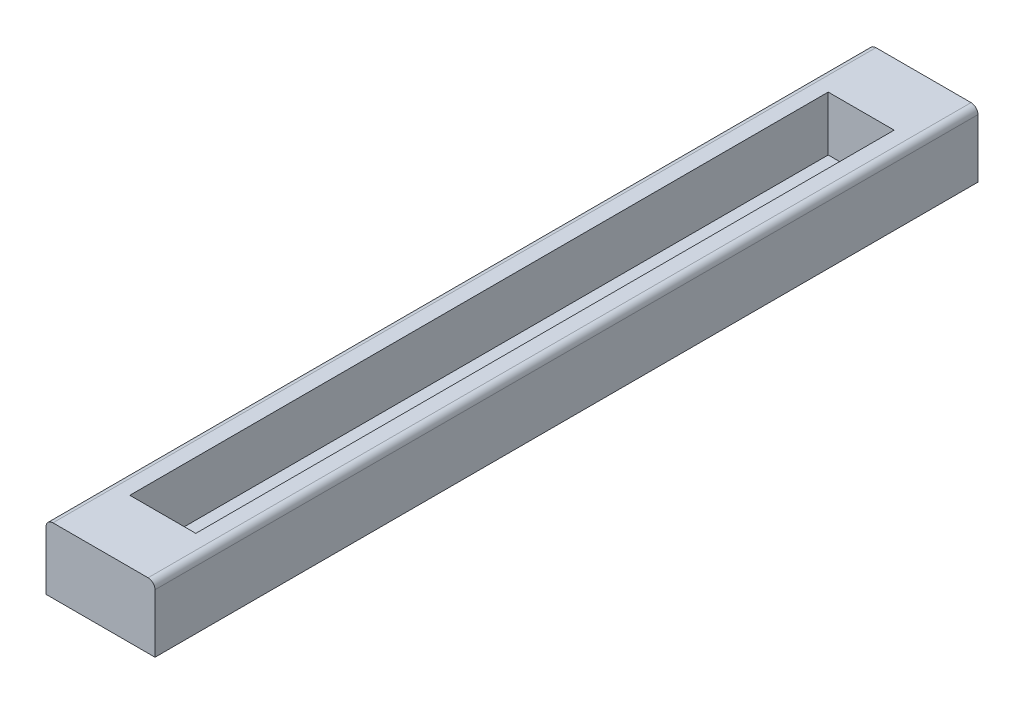
ISO-10303-21;
HEADER;
FILE_DESCRIPTION(('STEP AP214'),'2;1');
FILE_NAME('part.step','',(''),(''),'','','');
FILE_SCHEMA(('AUTOMOTIVE_DESIGN { 1 0 10303 214 1 1 1 1 }'));
ENDSEC;
DATA;
#1=APPLICATION_CONTEXT('core data for automotive mechanical design processes');
#2=APPLICATION_PROTOCOL_DEFINITION('international standard','automotive_design',2000,#1);
#3=PRODUCT_CONTEXT('',#1,'mechanical');
#4=PRODUCT('Part','Part','',(#3));
#5=PRODUCT_RELATED_PRODUCT_CATEGORY('part','',(#4));
#6=PRODUCT_DEFINITION_FORMATION('','',#4);
#7=PRODUCT_DEFINITION_CONTEXT('part definition',#1,'design');
#8=PRODUCT_DEFINITION('design','',#6,#7);
#9=PRODUCT_DEFINITION_SHAPE('','',#8);
#10=(LENGTH_UNIT() NAMED_UNIT(*) SI_UNIT(.MILLI.,.METRE.));
#11=(NAMED_UNIT(*) PLANE_ANGLE_UNIT() SI_UNIT($,.RADIAN.));
#12=(NAMED_UNIT(*) SI_UNIT($,.STERADIAN.) SOLID_ANGLE_UNIT());
#13=UNCERTAINTY_MEASURE_WITH_UNIT(LENGTH_MEASURE(1.E-05),#10,'distance_accuracy_value','');
#14=(GEOMETRIC_REPRESENTATION_CONTEXT(3) GLOBAL_UNCERTAINTY_ASSIGNED_CONTEXT((#13)) GLOBAL_UNIT_ASSIGNED_CONTEXT((#10,
#11,#12)) REPRESENTATION_CONTEXT('',''));
#15=CARTESIAN_POINT('',(0.,0.,0.));
#16=DIRECTION('',(0.,0.,1.));
#17=DIRECTION('',(1.,0.,0.));
#18=AXIS2_PLACEMENT_3D('',#15,#16,#17);
#19=CARTESIAN_POINT('',(0.605,0.2,7.55));
#20=DIRECTION('',(0.,-1.,0.));
#21=DIRECTION('',(0.,0.,-1.));
#22=AXIS2_PLACEMENT_3D('',#19,#20,#21);
#23=PLANE('',#22);
#24=DIRECTION('',(0.,0.,1.));
#25=VECTOR('',#24,1.);
#26=CARTESIAN_POINT('',(-0.605,0.2,7.55));
#27=LINE('',#26,#25);
#28=CARTESIAN_POINT('',(-0.605,0.2,-6.407));
#29=VERTEX_POINT('',#28);
#30=CARTESIAN_POINT('',(-0.605,0.2,6.407));
#31=VERTEX_POINT('',#30);
#32=EDGE_CURVE('E116',#29,#31,#27,.T.);
#33=ORIENTED_EDGE('',*,*,#32,.T.);
#34=DIRECTION('',(1.,0.,0.));
#35=VECTOR('',#34,1.);
#36=CARTESIAN_POINT('',(-0.873,0.2,6.407));
#37=LINE('',#36,#35);
#38=CARTESIAN_POINT('',(0.605,0.2,6.407));
#39=VERTEX_POINT('',#38);
#40=EDGE_CURVE('E113',#31,#39,#37,.T.);
#41=ORIENTED_EDGE('',*,*,#40,.T.);
#42=DIRECTION('',(0.,0.,-1.));
#43=VECTOR('',#42,1.);
#44=CARTESIAN_POINT('',(0.605,0.2,7.55));
#45=LINE('',#44,#43);
#46=CARTESIAN_POINT('',(0.605,0.2,-6.407));
#47=VERTEX_POINT('',#46);
#48=EDGE_CURVE('E159',#39,#47,#45,.T.);
#49=ORIENTED_EDGE('',*,*,#48,.T.);
#50=DIRECTION('',(1.,0.,0.));
#51=VECTOR('',#50,1.);
#52=CARTESIAN_POINT('',(0.605,0.2,-6.407));
#53=LINE('',#52,#51);
#54=EDGE_CURVE('E166',#29,#47,#53,.T.);
#55=ORIENTED_EDGE('',*,*,#54,.F.);
#56=EDGE_LOOP('',(#33,#41,#49,#55));
#57=FACE_BOUND('',#56,.T.);
#58=ADVANCED_FACE('F17',(#57),#23,.F.);
#59=CARTESIAN_POINT('',(-0.605,0.2,7.55));
#60=DIRECTION('',(-1.,0.,0.));
#61=DIRECTION('',(0.,0.,1.));
#62=AXIS2_PLACEMENT_3D('',#59,#60,#61);
#63=PLANE('',#62);
#64=DIRECTION('',(0.,0.,1.));
#65=VECTOR('',#64,1.);
#66=CARTESIAN_POINT('',(-0.605,1.2,7.55));
#67=LINE('',#66,#65);
#68=CARTESIAN_POINT('',(-0.605,1.2,-6.407));
#69=VERTEX_POINT('',#68);
#70=CARTESIAN_POINT('',(-0.605,1.2,6.407));
#71=VERTEX_POINT('',#70);
#72=EDGE_CURVE('E102',#69,#71,#67,.T.);
#73=ORIENTED_EDGE('',*,*,#72,.T.);
#74=DIRECTION('',(0.,1.,0.));
#75=VECTOR('',#74,1.);
#76=CARTESIAN_POINT('',(-0.605,1.073,6.407));
#77=LINE('',#76,#75);
#78=EDGE_CURVE('E109',#71,#31,#77,.F.);
#79=ORIENTED_EDGE('',*,*,#78,.T.);
#80=ORIENTED_EDGE('',*,*,#32,.F.);
#81=DIRECTION('',(0.,1.,0.));
#82=VECTOR('',#81,1.);
#83=CARTESIAN_POINT('',(-0.605,1.073,-6.407));
#84=LINE('',#83,#82);
#85=EDGE_CURVE('E126',#29,#69,#84,.T.);
#86=ORIENTED_EDGE('',*,*,#85,.T.);
#87=EDGE_LOOP('',(#73,#79,#80,#86));
#88=FACE_BOUND('',#87,.T.);
#89=ADVANCED_FACE('F124',(#88),#63,.F.);
#90=CARTESIAN_POINT('',(-0.873,1.073,6.407));
#91=DIRECTION('',(0.,0.,1.));
#92=DIRECTION('',(1.,0.,0.));
#93=AXIS2_PLACEMENT_3D('',#90,#91,#92);
#94=PLANE('',#93);
#95=DIRECTION('',(0.,1.,0.));
#96=VECTOR('',#95,1.);
#97=CARTESIAN_POINT('',(0.605,1.2,6.407));
#98=LINE('',#97,#96);
#99=CARTESIAN_POINT('',(0.605,1.2,6.407));
#100=VERTEX_POINT('',#99);
#101=EDGE_CURVE('E162',#100,#39,#98,.F.);
#102=ORIENTED_EDGE('',*,*,#101,.T.);
#103=ORIENTED_EDGE('',*,*,#40,.F.);
#104=ORIENTED_EDGE('',*,*,#78,.F.);
#105=DIRECTION('',(1.,0.,0.));
#106=VECTOR('',#105,1.);
#107=CARTESIAN_POINT('',(-0.605,1.2,6.407));
#108=LINE('',#107,#106);
#109=EDGE_CURVE('E112',#71,#100,#108,.T.);
#110=ORIENTED_EDGE('',*,*,#109,.T.);
#111=EDGE_LOOP('',(#102,#103,#104,#110));
#112=FACE_BOUND('',#111,.T.);
#113=ADVANCED_FACE('F111',(#112),#94,.F.);
#114=CARTESIAN_POINT('',(0.605,1.2,7.55));
#115=DIRECTION('',(1.,0.,0.));
#116=DIRECTION('',(0.,0.,-1.));
#117=AXIS2_PLACEMENT_3D('',#114,#115,#116);
#118=PLANE('',#117);
#119=ORIENTED_EDGE('',*,*,#48,.F.);
#120=ORIENTED_EDGE('',*,*,#101,.F.);
#121=DIRECTION('',(0.,0.,1.));
#122=VECTOR('',#121,1.);
#123=CARTESIAN_POINT('',(0.605,1.2,7.55));
#124=LINE('',#123,#122);
#125=CARTESIAN_POINT('',(0.605,1.2,-6.407));
#126=VERTEX_POINT('',#125);
#127=EDGE_CURVE('E122',#100,#126,#124,.F.);
#128=ORIENTED_EDGE('',*,*,#127,.T.);
#129=DIRECTION('',(0.,1.,0.));
#130=VECTOR('',#129,1.);
#131=CARTESIAN_POINT('',(0.605,1.073,-6.407));
#132=LINE('',#131,#130);
#133=EDGE_CURVE('E155',#126,#47,#132,.F.);
#134=ORIENTED_EDGE('',*,*,#133,.T.);
#135=EDGE_LOOP('',(#119,#120,#128,#134));
#136=FACE_BOUND('',#135,.T.);
#137=ADVANCED_FACE('F201',(#136),#118,.F.);
#138=CARTESIAN_POINT('',(-0.873,1.073,-6.407));
#139=DIRECTION('',(0.,0.,-1.));
#140=DIRECTION('',(-1.,0.,0.));
#141=AXIS2_PLACEMENT_3D('',#138,#139,#140);
#142=PLANE('',#141);
#143=ORIENTED_EDGE('',*,*,#133,.F.);
#144=DIRECTION('',(1.,0.,0.));
#145=VECTOR('',#144,1.);
#146=CARTESIAN_POINT('',(-0.605,1.2,-6.407));
#147=LINE('',#146,#145);
#148=EDGE_CURVE('E192',#126,#69,#147,.F.);
#149=ORIENTED_EDGE('',*,*,#148,.T.);
#150=ORIENTED_EDGE('',*,*,#85,.F.);
#151=ORIENTED_EDGE('',*,*,#54,.T.);
#152=EDGE_LOOP('',(#143,#149,#150,#151));
#153=FACE_BOUND('',#152,.T.);
#154=ADVANCED_FACE('F204',(#153),#142,.F.);
#155=CARTESIAN_POINT('',(-0.873,1.073,7.55));
#156=DIRECTION('',(0.,0.,-1.));
#157=DIRECTION('',(-1.,0.,0.));
#158=AXIS2_PLACEMENT_3D('',#155,#156,#157);
#159=CYLINDRICAL_SURFACE('',#158,0.127);
#160=CARTESIAN_POINT('',(-0.873,1.073,7.55));
#161=DIRECTION('',(0.,0.,-1.));
#162=DIRECTION('',(-1.,0.,0.));
#163=AXIS2_PLACEMENT_3D('',#160,#161,#162);
#164=CIRCLE('',#163,0.127);
#165=CARTESIAN_POINT('',(-1.,1.073,7.55));
#166=VERTEX_POINT('',#165);
#167=CARTESIAN_POINT('',(-0.873,1.2,7.55));
#168=VERTEX_POINT('',#167);
#169=EDGE_CURVE('E171',#166,#168,#164,.T.);
#170=ORIENTED_EDGE('',*,*,#169,.T.);
#171=DIRECTION('',(0.,0.,1.));
#172=VECTOR('',#171,1.);
#173=CARTESIAN_POINT('',(-0.873,1.2,7.55));
#174=LINE('',#173,#172);
#175=CARTESIAN_POINT('',(-0.873,1.2,-7.55));
#176=VERTEX_POINT('',#175);
#177=EDGE_CURVE('E131',#168,#176,#174,.F.);
#178=ORIENTED_EDGE('',*,*,#177,.T.);
#179=CARTESIAN_POINT('',(-0.873,1.073,-7.55));
#180=DIRECTION('',(0.,0.,-1.));
#181=DIRECTION('',(-1.,0.,0.));
#182=AXIS2_PLACEMENT_3D('',#179,#180,#181);
#183=CIRCLE('',#182,0.127);
#184=CARTESIAN_POINT('',(-1.,1.073,-7.55));
#185=VERTEX_POINT('',#184);
#186=EDGE_CURVE('E20',#176,#185,#183,.F.);
#187=ORIENTED_EDGE('',*,*,#186,.T.);
#188=DIRECTION('',(0.,0.,1.));
#189=VECTOR('',#188,1.);
#190=CARTESIAN_POINT('',(-1.,1.073,7.55));
#191=LINE('',#190,#189);
#192=EDGE_CURVE('E175',#185,#166,#191,.T.);
#193=ORIENTED_EDGE('',*,*,#192,.T.);
#194=EDGE_LOOP('',(#170,#178,#187,#193));
#195=FACE_BOUND('',#194,.T.);
#196=ADVANCED_FACE('F173',(#195),#159,.T.);
#197=CARTESIAN_POINT('',(0.873,1.073,7.55));
#198=DIRECTION('',(0.,0.,-1.));
#199=DIRECTION('',(-1.,0.,0.));
#200=AXIS2_PLACEMENT_3D('',#197,#198,#199);
#201=CYLINDRICAL_SURFACE('',#200,0.127);
#202=CARTESIAN_POINT('',(0.873,1.073,7.55));
#203=DIRECTION('',(0.,0.,-1.));
#204=DIRECTION('',(-1.,0.,0.));
#205=AXIS2_PLACEMENT_3D('',#202,#203,#204);
#206=CIRCLE('',#205,0.127);
#207=CARTESIAN_POINT('',(1.,1.073,7.55));
#208=VERTEX_POINT('',#207);
#209=CARTESIAN_POINT('',(0.873,1.2,7.55));
#210=VERTEX_POINT('',#209);
#211=EDGE_CURVE('E168',#208,#210,#206,.F.);
#212=ORIENTED_EDGE('',*,*,#211,.F.);
#213=DIRECTION('',(0.,0.,1.));
#214=VECTOR('',#213,1.);
#215=CARTESIAN_POINT('',(1.,1.073,7.55));
#216=LINE('',#215,#214);
#217=CARTESIAN_POINT('',(1.,1.073,-7.55));
#218=VERTEX_POINT('',#217);
#219=EDGE_CURVE('E137',#208,#218,#216,.F.);
#220=ORIENTED_EDGE('',*,*,#219,.T.);
#221=CARTESIAN_POINT('',(0.873,1.073,-7.55));
#222=DIRECTION('',(0.,0.,-1.));
#223=DIRECTION('',(-1.,0.,0.));
#224=AXIS2_PLACEMENT_3D('',#221,#222,#223);
#225=CIRCLE('',#224,0.127);
#226=CARTESIAN_POINT('',(0.873,1.2,-7.55));
#227=VERTEX_POINT('',#226);
#228=EDGE_CURVE('E136',#218,#227,#225,.F.);
#229=ORIENTED_EDGE('',*,*,#228,.T.);
#230=DIRECTION('',(0.,0.,1.));
#231=VECTOR('',#230,1.);
#232=CARTESIAN_POINT('',(0.873,1.2,7.55));
#233=LINE('',#232,#231);
#234=EDGE_CURVE('E128',#227,#210,#233,.T.);
#235=ORIENTED_EDGE('',*,*,#234,.T.);
#236=EDGE_LOOP('',(#212,#220,#229,#235));
#237=FACE_BOUND('',#236,.T.);
#238=ADVANCED_FACE('F212',(#237),#201,.T.);
#239=CARTESIAN_POINT('',(-0.605,1.2,7.55));
#240=DIRECTION('',(0.,-1.,0.));
#241=DIRECTION('',(1.,0.,0.));
#242=AXIS2_PLACEMENT_3D('',#239,#240,#241);
#243=PLANE('',#242);
#244=ORIENTED_EDGE('',*,*,#127,.F.);
#245=ORIENTED_EDGE('',*,*,#109,.F.);
#246=ORIENTED_EDGE('',*,*,#72,.F.);
#247=ORIENTED_EDGE('',*,*,#148,.F.);
#248=EDGE_LOOP('',(#244,#245,#246,#247));
#249=FACE_BOUND('',#248,.T.);
#250=DIRECTION('',(1.,0.,0.));
#251=VECTOR('',#250,1.);
#252=CARTESIAN_POINT('',(0.873,1.2,-7.55));
#253=LINE('',#252,#251);
#254=EDGE_CURVE('E181',#227,#176,#253,.F.);
#255=ORIENTED_EDGE('',*,*,#254,.T.);
#256=ORIENTED_EDGE('',*,*,#177,.F.);
#257=DIRECTION('',(1.,0.,0.));
#258=VECTOR('',#257,1.);
#259=CARTESIAN_POINT('',(0.873,1.2,7.55));
#260=LINE('',#259,#258);
#261=EDGE_CURVE('E148',#210,#168,#260,.F.);
#262=ORIENTED_EDGE('',*,*,#261,.F.);
#263=ORIENTED_EDGE('',*,*,#234,.F.);
#264=EDGE_LOOP('',(#255,#256,#262,#263));
#265=FACE_BOUND('',#264,.T.);
#266=ADVANCED_FACE('F119',(#249,#265),#243,.F.);
#267=CARTESIAN_POINT('',(-1.,1.073,7.55));
#268=DIRECTION('',(1.,0.,0.));
#269=DIRECTION('',(0.,1.,0.));
#270=AXIS2_PLACEMENT_3D('',#267,#268,#269);
#271=PLANE('',#270);
#272=DIRECTION('',(0.,0.,1.));
#273=VECTOR('',#272,1.);
#274=CARTESIAN_POINT('',(-1.,0.,7.55));
#275=LINE('',#274,#273);
#276=CARTESIAN_POINT('',(-1.,0.,-7.55));
#277=VERTEX_POINT('',#276);
#278=CARTESIAN_POINT('',(-1.,0.,7.55));
#279=VERTEX_POINT('',#278);
#280=EDGE_CURVE('E90',#277,#279,#275,.T.);
#281=ORIENTED_EDGE('',*,*,#280,.T.);
#282=DIRECTION('',(0.,1.,0.));
#283=VECTOR('',#282,1.);
#284=CARTESIAN_POINT('',(-1.,1.073,7.55));
#285=LINE('',#284,#283);
#286=EDGE_CURVE('E170',#166,#279,#285,.F.);
#287=ORIENTED_EDGE('',*,*,#286,.F.);
#288=ORIENTED_EDGE('',*,*,#192,.F.);
#289=DIRECTION('',(0.,1.,0.));
#290=VECTOR('',#289,1.);
#291=CARTESIAN_POINT('',(-1.,1.073,-7.55));
#292=LINE('',#291,#290);
#293=EDGE_CURVE('E194',#185,#277,#292,.F.);
#294=ORIENTED_EDGE('',*,*,#293,.T.);
#295=EDGE_LOOP('',(#281,#287,#288,#294));
#296=FACE_BOUND('',#295,.T.);
#297=ADVANCED_FACE('F231',(#296),#271,.F.);
#298=CARTESIAN_POINT('',(0.873,1.073,7.55));
#299=DIRECTION('',(0.,0.,1.));
#300=DIRECTION('',(1.,0.,0.));
#301=AXIS2_PLACEMENT_3D('',#298,#299,#300);
#302=PLANE('',#301);
#303=ORIENTED_EDGE('',*,*,#261,.T.);
#304=ORIENTED_EDGE('',*,*,#169,.F.);
#305=ORIENTED_EDGE('',*,*,#286,.T.);
#306=DIRECTION('',(-1.,0.,0.));
#307=VECTOR('',#306,1.);
#308=CARTESIAN_POINT('',(-1.,0.,7.55));
#309=LINE('',#308,#307);
#310=CARTESIAN_POINT('',(1.,0.,7.55));
#311=VERTEX_POINT('',#310);
#312=EDGE_CURVE('E143',#279,#311,#309,.F.);
#313=ORIENTED_EDGE('',*,*,#312,.T.);
#314=DIRECTION('',(0.,-1.,0.));
#315=VECTOR('',#314,1.);
#316=CARTESIAN_POINT('',(1.,0.,7.55));
#317=LINE('',#316,#315);
#318=EDGE_CURVE('E140',#311,#208,#317,.F.);
#319=ORIENTED_EDGE('',*,*,#318,.T.);
#320=ORIENTED_EDGE('',*,*,#211,.T.);
#321=EDGE_LOOP('',(#303,#304,#305,#313,#319,#320));
#322=FACE_BOUND('',#321,.T.);
#323=ADVANCED_FACE('F182',(#322),#302,.T.);
#324=CARTESIAN_POINT('',(1.,0.,7.55));
#325=DIRECTION('',(-1.,0.,0.));
#326=DIRECTION('',(0.,-1.,0.));
#327=AXIS2_PLACEMENT_3D('',#324,#325,#326);
#328=PLANE('',#327);
#329=ORIENTED_EDGE('',*,*,#219,.F.);
#330=ORIENTED_EDGE('',*,*,#318,.F.);
#331=DIRECTION('',(0.,0.,1.));
#332=VECTOR('',#331,1.);
#333=CARTESIAN_POINT('',(1.,0.,7.55));
#334=LINE('',#333,#332);
#335=CARTESIAN_POINT('',(1.,0.,-7.55));
#336=VERTEX_POINT('',#335);
#337=EDGE_CURVE('E26',#311,#336,#334,.F.);
#338=ORIENTED_EDGE('',*,*,#337,.T.);
#339=DIRECTION('',(0.,1.,0.));
#340=VECTOR('',#339,1.);
#341=CARTESIAN_POINT('',(1.,1.073,-7.55));
#342=LINE('',#341,#340);
#343=EDGE_CURVE('E34',#336,#218,#342,.T.);
#344=ORIENTED_EDGE('',*,*,#343,.T.);
#345=EDGE_LOOP('',(#329,#330,#338,#344));
#346=FACE_BOUND('',#345,.T.);
#347=ADVANCED_FACE('F222',(#346),#328,.F.);
#348=CARTESIAN_POINT('',(0.873,1.073,-7.55));
#349=DIRECTION('',(0.,0.,1.));
#350=DIRECTION('',(1.,0.,0.));
#351=AXIS2_PLACEMENT_3D('',#348,#349,#350);
#352=PLANE('',#351);
#353=ORIENTED_EDGE('',*,*,#186,.F.);
#354=ORIENTED_EDGE('',*,*,#254,.F.);
#355=ORIENTED_EDGE('',*,*,#228,.F.);
#356=ORIENTED_EDGE('',*,*,#343,.F.);
#357=DIRECTION('',(-1.,0.,0.));
#358=VECTOR('',#357,1.);
#359=CARTESIAN_POINT('',(-1.,0.,-7.55));
#360=LINE('',#359,#358);
#361=EDGE_CURVE('E11',#336,#277,#360,.T.);
#362=ORIENTED_EDGE('',*,*,#361,.T.);
#363=ORIENTED_EDGE('',*,*,#293,.F.);
#364=EDGE_LOOP('',(#353,#354,#355,#356,#362,#363));
#365=FACE_BOUND('',#364,.T.);
#366=ADVANCED_FACE('F217',(#365),#352,.F.);
#367=CARTESIAN_POINT('',(-1.,0.,7.55));
#368=DIRECTION('',(0.,1.,0.));
#369=DIRECTION('',(-1.,0.,0.));
#370=AXIS2_PLACEMENT_3D('',#367,#368,#369);
#371=PLANE('',#370);
#372=ORIENTED_EDGE('',*,*,#337,.F.);
#373=ORIENTED_EDGE('',*,*,#312,.F.);
#374=ORIENTED_EDGE('',*,*,#280,.F.);
#375=ORIENTED_EDGE('',*,*,#361,.F.);
#376=EDGE_LOOP('',(#372,#373,#374,#375));
#377=FACE_BOUND('',#376,.T.);
#378=ADVANCED_FACE('F215',(#377),#371,.F.);
#379=CLOSED_SHELL('',(#58,#89,#113,#137,#154,#196,#238,#266,#297,#323,#347,#366,#378));
#380=MANIFOLD_SOLID_BREP('B1',#379);
#381=ADVANCED_BREP_SHAPE_REPRESENTATION('',(#18,#380),#14);
#382=SHAPE_DEFINITION_REPRESENTATION(#9,#381);
ENDSEC;
END-ISO-10303-21;
